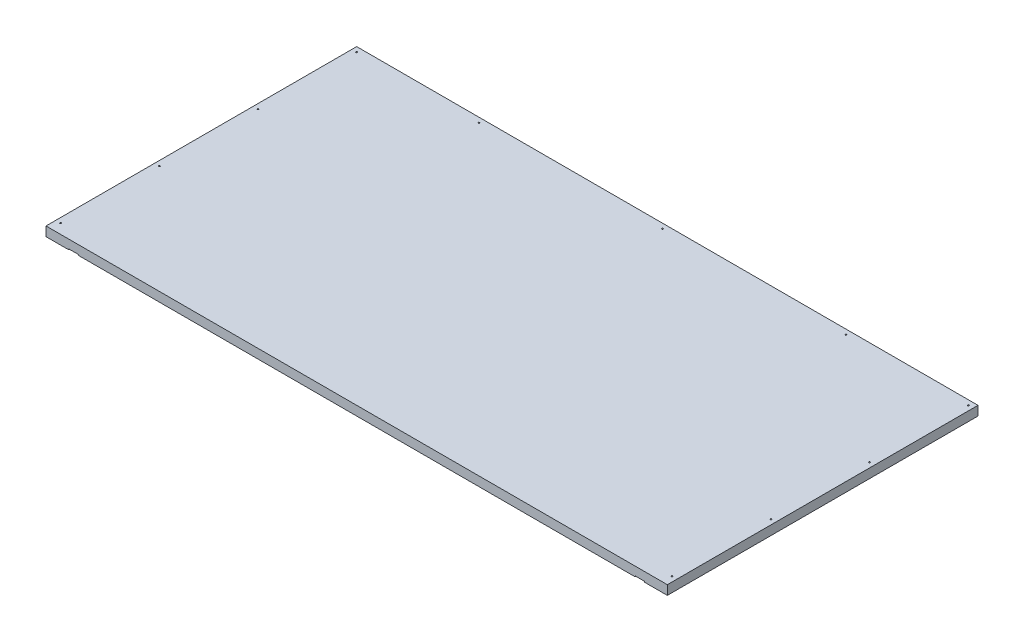
ISO-10303-21;
HEADER;
FILE_DESCRIPTION(('STEP AP214'),'2;1');
FILE_NAME('part.step','',(''),(''),'','','');
FILE_SCHEMA(('AUTOMOTIVE_DESIGN { 1 0 10303 214 1 1 1 1 }'));
ENDSEC;
DATA;
#1=APPLICATION_CONTEXT('core data for automotive mechanical design processes');
#2=APPLICATION_PROTOCOL_DEFINITION('international standard','automotive_design',2000,#1);
#3=PRODUCT_CONTEXT('',#1,'mechanical');
#4=PRODUCT('Part','Part','',(#3));
#5=PRODUCT_RELATED_PRODUCT_CATEGORY('part','',(#4));
#6=PRODUCT_DEFINITION_FORMATION('','',#4);
#7=PRODUCT_DEFINITION_CONTEXT('part definition',#1,'design');
#8=PRODUCT_DEFINITION('design','',#6,#7);
#9=PRODUCT_DEFINITION_SHAPE('','',#8);
#10=(LENGTH_UNIT() NAMED_UNIT(*) SI_UNIT(.MILLI.,.METRE.));
#11=(NAMED_UNIT(*) PLANE_ANGLE_UNIT() SI_UNIT($,.RADIAN.));
#12=(NAMED_UNIT(*) SI_UNIT($,.STERADIAN.) SOLID_ANGLE_UNIT());
#13=UNCERTAINTY_MEASURE_WITH_UNIT(LENGTH_MEASURE(1.E-05),#10,'distance_accuracy_value','');
#14=(GEOMETRIC_REPRESENTATION_CONTEXT(3) GLOBAL_UNCERTAINTY_ASSIGNED_CONTEXT((#13)) GLOBAL_UNIT_ASSIGNED_CONTEXT((#10,
#11,#12)) REPRESENTATION_CONTEXT('',''));
#15=CARTESIAN_POINT('',(0.,0.,0.));
#16=DIRECTION('',(0.,0.,1.));
#17=DIRECTION('',(1.,0.,0.));
#18=AXIS2_PLACEMENT_3D('',#15,#16,#17);
#19=CARTESIAN_POINT('',(-609.6,18.25625,-304.8));
#20=DIRECTION('',(0.,0.,1.));
#21=DIRECTION('',(1.,0.,0.));
#22=AXIS2_PLACEMENT_3D('',#19,#20,#21);
#23=PLANE('',#22);
#24=DIRECTION('',(0.,-1.,0.));
#25=VECTOR('',#24,1.);
#26=CARTESIAN_POINT('',(565.15,1.5875,-304.8));
#27=LINE('',#26,#25);
#28=CARTESIAN_POINT('',(565.15,1.5875,-304.8));
#29=VERTEX_POINT('',#28);
#30=CARTESIAN_POINT('',(565.15,0.,-304.8));
#31=VERTEX_POINT('',#30);
#32=EDGE_CURVE('E388',#29,#31,#27,.T.);
#33=ORIENTED_EDGE('',*,*,#32,.F.);
#34=DIRECTION('',(-1.,0.,0.));
#35=VECTOR('',#34,1.);
#36=CARTESIAN_POINT('',(565.15,1.5875,-304.8));
#37=LINE('',#36,#35);
#38=CARTESIAN_POINT('',(546.1,1.5875,-304.8));
#39=VERTEX_POINT('',#38);
#40=EDGE_CURVE('E461',#29,#39,#37,.T.);
#41=ORIENTED_EDGE('',*,*,#40,.T.);
#42=DIRECTION('',(0.,-1.,0.));
#43=VECTOR('',#42,1.);
#44=CARTESIAN_POINT('',(546.1,1.5875,-304.8));
#45=LINE('',#44,#43);
#46=CARTESIAN_POINT('',(546.1,0.,-304.8));
#47=VERTEX_POINT('',#46);
#48=EDGE_CURVE('E384',#39,#47,#45,.T.);
#49=ORIENTED_EDGE('',*,*,#48,.T.);
#50=DIRECTION('',(-1.,0.,0.));
#51=VECTOR('',#50,1.);
#52=CARTESIAN_POINT('',(-609.6,0.,-304.8));
#53=LINE('',#52,#51);
#54=CARTESIAN_POINT('',(120.65,0.,-304.8));
#55=VERTEX_POINT('',#54);
#56=EDGE_CURVE('E266',#47,#55,#53,.T.);
#57=ORIENTED_EDGE('',*,*,#56,.T.);
#58=DIRECTION('',(0.,-1.,0.));
#59=VECTOR('',#58,1.);
#60=CARTESIAN_POINT('',(120.65,1.5875,-304.8));
#61=LINE('',#60,#59);
#62=CARTESIAN_POINT('',(120.65,1.5875,-304.8));
#63=VERTEX_POINT('',#62);
#64=EDGE_CURVE('E375',#63,#55,#61,.T.);
#65=ORIENTED_EDGE('',*,*,#64,.F.);
#66=DIRECTION('',(-1.,0.,0.));
#67=VECTOR('',#66,1.);
#68=CARTESIAN_POINT('',(101.6,1.5875,-304.8));
#69=LINE('',#68,#67);
#70=CARTESIAN_POINT('',(101.6,1.5875,-304.8));
#71=VERTEX_POINT('',#70);
#72=EDGE_CURVE('E448',#63,#71,#69,.T.);
#73=ORIENTED_EDGE('',*,*,#72,.T.);
#74=DIRECTION('',(0.,-1.,0.));
#75=VECTOR('',#74,1.);
#76=CARTESIAN_POINT('',(101.6,1.5875,-304.8));
#77=LINE('',#76,#75);
#78=CARTESIAN_POINT('',(101.6,0.,-304.8));
#79=VERTEX_POINT('',#78);
#80=EDGE_CURVE('E371',#71,#79,#77,.T.);
#81=ORIENTED_EDGE('',*,*,#80,.T.);
#82=CARTESIAN_POINT('',(-101.6,0.,-304.8));
#83=VERTEX_POINT('',#82);
#84=EDGE_CURVE('E416',#79,#83,#53,.T.);
#85=ORIENTED_EDGE('',*,*,#84,.T.);
#86=DIRECTION('',(0.,-1.,0.));
#87=VECTOR('',#86,1.);
#88=CARTESIAN_POINT('',(-101.6,1.5875,-304.8));
#89=LINE('',#88,#87);
#90=CARTESIAN_POINT('',(-101.6,1.5875,-304.8));
#91=VERTEX_POINT('',#90);
#92=EDGE_CURVE('E362',#91,#83,#89,.T.);
#93=ORIENTED_EDGE('',*,*,#92,.F.);
#94=DIRECTION('',(-1.,0.,0.));
#95=VECTOR('',#94,1.);
#96=CARTESIAN_POINT('',(-120.65,1.5875,-304.8));
#97=LINE('',#96,#95);
#98=CARTESIAN_POINT('',(-120.65,1.5875,-304.8));
#99=VERTEX_POINT('',#98);
#100=EDGE_CURVE('E435',#91,#99,#97,.T.);
#101=ORIENTED_EDGE('',*,*,#100,.T.);
#102=DIRECTION('',(0.,-1.,0.));
#103=VECTOR('',#102,1.);
#104=CARTESIAN_POINT('',(-120.65,1.5875,-304.8));
#105=LINE('',#104,#103);
#106=CARTESIAN_POINT('',(-120.65,0.,-304.8));
#107=VERTEX_POINT('',#106);
#108=EDGE_CURVE('E358',#99,#107,#105,.T.);
#109=ORIENTED_EDGE('',*,*,#108,.T.);
#110=CARTESIAN_POINT('',(-546.1,0.,-304.8));
#111=VERTEX_POINT('',#110);
#112=EDGE_CURVE('E419',#107,#111,#53,.T.);
#113=ORIENTED_EDGE('',*,*,#112,.T.);
#114=DIRECTION('',(0.,-1.,0.));
#115=VECTOR('',#114,1.);
#116=CARTESIAN_POINT('',(-546.1,1.5875,-304.8));
#117=LINE('',#116,#115);
#118=CARTESIAN_POINT('',(-546.1,1.5875,-304.8));
#119=VERTEX_POINT('',#118);
#120=EDGE_CURVE('E54',#119,#111,#117,.T.);
#121=ORIENTED_EDGE('',*,*,#120,.F.);
#122=DIRECTION('',(-1.,0.,0.));
#123=VECTOR('',#122,1.);
#124=CARTESIAN_POINT('',(-565.15,1.5875,-304.8));
#125=LINE('',#124,#123);
#126=CARTESIAN_POINT('',(-565.15,1.5875,-304.8));
#127=VERTEX_POINT('',#126);
#128=EDGE_CURVE('E300',#119,#127,#125,.T.);
#129=ORIENTED_EDGE('',*,*,#128,.T.);
#130=DIRECTION('',(0.,-1.,0.));
#131=VECTOR('',#130,1.);
#132=CARTESIAN_POINT('',(-565.15,1.5875,-304.8));
#133=LINE('',#132,#131);
#134=CARTESIAN_POINT('',(-565.15,0.,-304.8));
#135=VERTEX_POINT('',#134);
#136=EDGE_CURVE('E228',#127,#135,#133,.T.);
#137=ORIENTED_EDGE('',*,*,#136,.T.);
#138=CARTESIAN_POINT('',(-609.6,0.,-304.8));
#139=VERTEX_POINT('',#138);
#140=EDGE_CURVE('E244',#135,#139,#53,.T.);
#141=ORIENTED_EDGE('',*,*,#140,.T.);
#142=DIRECTION('',(0.,-1.,0.));
#143=VECTOR('',#142,1.);
#144=CARTESIAN_POINT('',(-609.6,18.25625,-304.8));
#145=LINE('',#144,#143);
#146=CARTESIAN_POINT('',(-609.6,18.25625,-304.8));
#147=VERTEX_POINT('',#146);
#148=EDGE_CURVE('E47',#147,#139,#145,.T.);
#149=ORIENTED_EDGE('',*,*,#148,.F.);
#150=DIRECTION('',(-1.,0.,0.));
#151=VECTOR('',#150,1.);
#152=CARTESIAN_POINT('',(-609.6,18.25625,-304.8));
#153=LINE('',#152,#151);
#154=CARTESIAN_POINT('',(609.6,18.25625,-304.8));
#155=VERTEX_POINT('',#154);
#156=EDGE_CURVE('E91',#155,#147,#153,.T.);
#157=ORIENTED_EDGE('',*,*,#156,.F.);
#158=DIRECTION('',(0.,-1.,0.));
#159=VECTOR('',#158,1.);
#160=CARTESIAN_POINT('',(609.6,18.25625,-304.8));
#161=LINE('',#160,#159);
#162=CARTESIAN_POINT('',(609.6,0.,-304.8));
#163=VERTEX_POINT('',#162);
#164=EDGE_CURVE('E11',#155,#163,#161,.T.);
#165=ORIENTED_EDGE('',*,*,#164,.T.);
#166=EDGE_CURVE('E261',#163,#31,#53,.T.);
#167=ORIENTED_EDGE('',*,*,#166,.T.);
#168=EDGE_LOOP('',(#33,#41,#49,#57,#65,#73,#81,#85,#93,#101,#109,#113,#121,#129,#137,#141,#149,
#157,#165,#167));
#169=FACE_BOUND('',#168,.T.);
#170=ADVANCED_FACE('F38',(#169),#23,.F.);
#171=CARTESIAN_POINT('',(-609.6,18.25625,304.8));
#172=DIRECTION('',(0.,0.,-1.));
#173=DIRECTION('',(-1.,0.,0.));
#174=AXIS2_PLACEMENT_3D('',#171,#172,#173);
#175=PLANE('',#174);
#176=DIRECTION('',(0.,-1.,0.));
#177=VECTOR('',#176,1.);
#178=CARTESIAN_POINT('',(-565.15,1.5875,304.8));
#179=LINE('',#178,#177);
#180=CARTESIAN_POINT('',(-565.15,1.5875,304.8));
#181=VERTEX_POINT('',#180);
#182=CARTESIAN_POINT('',(-565.15,0.,304.8));
#183=VERTEX_POINT('',#182);
#184=EDGE_CURVE('E225',#181,#183,#179,.T.);
#185=ORIENTED_EDGE('',*,*,#184,.F.);
#186=DIRECTION('',(1.,0.,0.));
#187=VECTOR('',#186,1.);
#188=CARTESIAN_POINT('',(-565.15,1.5875,304.8));
#189=LINE('',#188,#187);
#190=CARTESIAN_POINT('',(-546.1,1.5875,304.8));
#191=VERTEX_POINT('',#190);
#192=EDGE_CURVE('E211',#181,#191,#189,.T.);
#193=ORIENTED_EDGE('',*,*,#192,.T.);
#194=DIRECTION('',(0.,-1.,0.));
#195=VECTOR('',#194,1.);
#196=CARTESIAN_POINT('',(-546.1,1.5875,304.8));
#197=LINE('',#196,#195);
#198=CARTESIAN_POINT('',(-546.1,0.,304.8));
#199=VERTEX_POINT('',#198);
#200=EDGE_CURVE('E239',#191,#199,#197,.T.);
#201=ORIENTED_EDGE('',*,*,#200,.T.);
#202=DIRECTION('',(1.,0.,0.));
#203=VECTOR('',#202,1.);
#204=CARTESIAN_POINT('',(-609.6,0.,304.8));
#205=LINE('',#204,#203);
#206=CARTESIAN_POINT('',(546.1,0.,304.8));
#207=VERTEX_POINT('',#206);
#208=EDGE_CURVE('E271',#199,#207,#205,.T.);
#209=ORIENTED_EDGE('',*,*,#208,.T.);
#210=DIRECTION('',(0.,-1.,0.));
#211=VECTOR('',#210,1.);
#212=CARTESIAN_POINT('',(546.1,1.5875,304.8));
#213=LINE('',#212,#211);
#214=CARTESIAN_POINT('',(546.1,1.5875,304.8));
#215=VERTEX_POINT('',#214);
#216=EDGE_CURVE('E394',#215,#207,#213,.T.);
#217=ORIENTED_EDGE('',*,*,#216,.F.);
#218=DIRECTION('',(1.,0.,0.));
#219=VECTOR('',#218,1.);
#220=CARTESIAN_POINT('',(565.15,1.5875,304.8));
#221=LINE('',#220,#219);
#222=CARTESIAN_POINT('',(565.15,1.5875,304.8));
#223=VERTEX_POINT('',#222);
#224=EDGE_CURVE('E468',#215,#223,#221,.T.);
#225=ORIENTED_EDGE('',*,*,#224,.T.);
#226=DIRECTION('',(0.,-1.,0.));
#227=VECTOR('',#226,1.);
#228=CARTESIAN_POINT('',(565.15,1.5875,304.8));
#229=LINE('',#228,#227);
#230=CARTESIAN_POINT('',(565.15,0.,304.8));
#231=VERTEX_POINT('',#230);
#232=EDGE_CURVE('E391',#223,#231,#229,.T.);
#233=ORIENTED_EDGE('',*,*,#232,.T.);
#234=CARTESIAN_POINT('',(609.6,0.,304.8));
#235=VERTEX_POINT('',#234);
#236=EDGE_CURVE('E84',#231,#235,#205,.T.);
#237=ORIENTED_EDGE('',*,*,#236,.T.);
#238=DIRECTION('',(0.,-1.,0.));
#239=VECTOR('',#238,1.);
#240=CARTESIAN_POINT('',(609.6,18.25625,304.8));
#241=LINE('',#240,#239);
#242=CARTESIAN_POINT('',(609.6,18.25625,304.8));
#243=VERTEX_POINT('',#242);
#244=EDGE_CURVE('E259',#243,#235,#241,.T.);
#245=ORIENTED_EDGE('',*,*,#244,.F.);
#246=DIRECTION('',(1.,0.,0.));
#247=VECTOR('',#246,1.);
#248=CARTESIAN_POINT('',(-609.6,18.25625,304.8));
#249=LINE('',#248,#247);
#250=CARTESIAN_POINT('',(-609.6,18.25625,304.8));
#251=VERTEX_POINT('',#250);
#252=EDGE_CURVE('E63',#251,#243,#249,.T.);
#253=ORIENTED_EDGE('',*,*,#252,.F.);
#254=DIRECTION('',(0.,-1.,0.));
#255=VECTOR('',#254,1.);
#256=CARTESIAN_POINT('',(-609.6,18.25625,304.8));
#257=LINE('',#256,#255);
#258=CARTESIAN_POINT('',(-609.6,0.,304.8));
#259=VERTEX_POINT('',#258);
#260=EDGE_CURVE('E274',#251,#259,#257,.T.);
#261=ORIENTED_EDGE('',*,*,#260,.T.);
#262=EDGE_CURVE('E236',#259,#183,#205,.T.);
#263=ORIENTED_EDGE('',*,*,#262,.T.);
#264=EDGE_LOOP('',(#185,#193,#201,#209,#217,#225,#233,#237,#245,#253,#261,#263));
#265=FACE_BOUND('',#264,.T.);
#266=ADVANCED_FACE('F233',(#265),#175,.F.);
#267=CARTESIAN_POINT('',(0.,0.,0.));
#268=DIRECTION('',(0.,-1.,0.));
#269=DIRECTION('',(0.,0.,-1.));
#270=AXIS2_PLACEMENT_3D('',#267,#268,#269);
#271=PLANE('',#270);
#272=CARTESIAN_POINT('',(-600.075000000001,0.,92.0750000000001));
#273=DIRECTION('',(0.,1.,0.));
#274=DIRECTION('',(0.,0.,1.));
#275=AXIS2_PLACEMENT_3D('',#272,#273,#274);
#276=CIRCLE('',#275,1.39699999999999);
#277=CARTESIAN_POINT('',(-600.075000000001,0.,93.4720000000001));
#278=VERTEX_POINT('',#277);
#279=EDGE_CURVE('E536',#278,#278,#276,.T.);
#280=ORIENTED_EDGE('',*,*,#279,.T.);
#281=EDGE_LOOP('',(#280));
#282=FACE_BOUND('',#281,.T.);
#283=CARTESIAN_POINT('',(-600.075000000001,0.,-101.6));
#284=DIRECTION('',(0.,1.,0.));
#285=DIRECTION('',(0.,0.,1.));
#286=AXIS2_PLACEMENT_3D('',#283,#284,#285);
#287=CIRCLE('',#286,1.39699999999999);
#288=CARTESIAN_POINT('',(-600.075000000001,0.,-100.203));
#289=VERTEX_POINT('',#288);
#290=EDGE_CURVE('E537',#289,#289,#287,.T.);
#291=ORIENTED_EDGE('',*,*,#290,.T.);
#292=EDGE_LOOP('',(#291));
#293=FACE_BOUND('',#292,.T.);
#294=CARTESIAN_POINT('',(-600.075000000002,0.,-295.275));
#295=DIRECTION('',(0.,1.,0.));
#296=DIRECTION('',(0.,0.,1.));
#297=AXIS2_PLACEMENT_3D('',#294,#295,#296);
#298=CIRCLE('',#297,1.39699999999998);
#299=CARTESIAN_POINT('',(-600.075000000002,0.,-293.878));
#300=VERTEX_POINT('',#299);
#301=EDGE_CURVE('E552',#300,#300,#298,.T.);
#302=ORIENTED_EDGE('',*,*,#301,.T.);
#303=EDGE_LOOP('',(#302));
#304=FACE_BOUND('',#303,.T.);
#305=CARTESIAN_POINT('',(-600.075,0.,285.75));
#306=DIRECTION('',(0.,1.,0.));
#307=DIRECTION('',(0.,0.,1.));
#308=AXIS2_PLACEMENT_3D('',#305,#306,#307);
#309=CIRCLE('',#308,1.39699999999998);
#310=CARTESIAN_POINT('',(-600.075,0.,287.147));
#311=VERTEX_POINT('',#310);
#312=EDGE_CURVE('E289',#311,#311,#309,.T.);
#313=ORIENTED_EDGE('',*,*,#312,.T.);
#314=EDGE_LOOP('',(#313));
#315=FACE_BOUND('',#314,.T.);
#316=ORIENTED_EDGE('',*,*,#140,.F.);
#317=DIRECTION('',(0.,0.,1.));
#318=VECTOR('',#317,1.);
#319=CARTESIAN_POINT('',(-565.15,0.,-304.8));
#320=LINE('',#319,#318);
#321=EDGE_CURVE('E286',#135,#183,#320,.T.);
#322=ORIENTED_EDGE('',*,*,#321,.T.);
#323=ORIENTED_EDGE('',*,*,#262,.F.);
#324=DIRECTION('',(0.,0.,1.));
#325=VECTOR('',#324,1.);
#326=CARTESIAN_POINT('',(-609.6,0.,304.8));
#327=LINE('',#326,#325);
#328=EDGE_CURVE('E265',#139,#259,#327,.T.);
#329=ORIENTED_EDGE('',*,*,#328,.F.);
#330=EDGE_LOOP('',(#316,#322,#323,#329));
#331=FACE_BOUND('',#330,.T.);
#332=ADVANCED_FACE('F285',(#282,#293,#304,#315,#331),#271,.T.);
#333=ORIENTED_EDGE('',*,*,#208,.F.);
#334=DIRECTION('',(0.,0.,-1.));
#335=VECTOR('',#334,1.);
#336=CARTESIAN_POINT('',(-546.1,0.,9.52500000000006));
#337=LINE('',#336,#335);
#338=CARTESIAN_POINT('',(-546.1,0.,9.52500000000006));
#339=VERTEX_POINT('',#338);
#340=EDGE_CURVE('E288',#199,#339,#337,.T.);
#341=ORIENTED_EDGE('',*,*,#340,.T.);
#342=DIRECTION('',(1.,0.,0.));
#343=VECTOR('',#342,1.);
#344=CARTESIAN_POINT('',(120.65,0.,9.52500000000003));
#345=LINE('',#344,#343);
#346=CARTESIAN_POINT('',(546.1,0.,9.52500000000006));
#347=VERTEX_POINT('',#346);
#348=EDGE_CURVE('E294',#339,#347,#345,.T.);
#349=ORIENTED_EDGE('',*,*,#348,.T.);
#350=DIRECTION('',(0.,0.,1.));
#351=VECTOR('',#350,1.);
#352=CARTESIAN_POINT('',(546.1,0.,9.52500000000006));
#353=LINE('',#352,#351);
#354=EDGE_CURVE('E306',#347,#207,#353,.T.);
#355=ORIENTED_EDGE('',*,*,#354,.T.);
#356=EDGE_LOOP('',(#333,#341,#349,#355));
#357=FACE_BOUND('',#356,.T.);
#358=ADVANCED_FACE('F407',(#357),#271,.T.);
#359=CARTESIAN_POINT('',(600.074999999999,0.,-295.275));
#360=DIRECTION('',(0.,1.,0.));
#361=DIRECTION('',(0.,0.,1.));
#362=AXIS2_PLACEMENT_3D('',#359,#360,#361);
#363=CIRCLE('',#362,1.39699999999998);
#364=CARTESIAN_POINT('',(600.074999999999,0.,-293.878));
#365=VERTEX_POINT('',#364);
#366=EDGE_CURVE('E521',#365,#365,#363,.T.);
#367=ORIENTED_EDGE('',*,*,#366,.T.);
#368=EDGE_LOOP('',(#367));
#369=FACE_BOUND('',#368,.T.);
#370=CARTESIAN_POINT('',(600.075,0.,-101.6));
#371=DIRECTION('',(0.,1.,0.));
#372=DIRECTION('',(0.,0.,1.));
#373=AXIS2_PLACEMENT_3D('',#370,#371,#372);
#374=CIRCLE('',#373,1.39699999999999);
#375=CARTESIAN_POINT('',(600.075,0.,-100.203));
#376=VERTEX_POINT('',#375);
#377=EDGE_CURVE('E497',#376,#376,#374,.T.);
#378=ORIENTED_EDGE('',*,*,#377,.T.);
#379=EDGE_LOOP('',(#378));
#380=FACE_BOUND('',#379,.T.);
#381=CARTESIAN_POINT('',(600.075000000001,0.,92.0750000000001));
#382=DIRECTION('',(0.,1.,0.));
#383=DIRECTION('',(0.,0.,1.));
#384=AXIS2_PLACEMENT_3D('',#381,#382,#383);
#385=CIRCLE('',#384,1.39699999999999);
#386=CARTESIAN_POINT('',(600.075000000001,0.,93.4720000000001));
#387=VERTEX_POINT('',#386);
#388=EDGE_CURVE('E505',#387,#387,#385,.T.);
#389=ORIENTED_EDGE('',*,*,#388,.T.);
#390=EDGE_LOOP('',(#389));
#391=FACE_BOUND('',#390,.T.);
#392=CARTESIAN_POINT('',(600.075000000001,0.,285.75));
#393=DIRECTION('',(0.,1.,0.));
#394=DIRECTION('',(0.,0.,1.));
#395=AXIS2_PLACEMENT_3D('',#392,#393,#394);
#396=CIRCLE('',#395,1.39699999999998);
#397=CARTESIAN_POINT('',(600.075000000001,0.,287.147));
#398=VERTEX_POINT('',#397);
#399=EDGE_CURVE('E482',#398,#398,#396,.T.);
#400=ORIENTED_EDGE('',*,*,#399,.T.);
#401=EDGE_LOOP('',(#400));
#402=FACE_BOUND('',#401,.T.);
#403=ORIENTED_EDGE('',*,*,#236,.F.);
#404=DIRECTION('',(0.,0.,-1.));
#405=VECTOR('',#404,1.);
#406=CARTESIAN_POINT('',(565.15,0.,-304.8));
#407=LINE('',#406,#405);
#408=EDGE_CURVE('E310',#231,#31,#407,.T.);
#409=ORIENTED_EDGE('',*,*,#408,.T.);
#410=ORIENTED_EDGE('',*,*,#166,.F.);
#411=DIRECTION('',(0.,0.,-1.));
#412=VECTOR('',#411,1.);
#413=CARTESIAN_POINT('',(609.6,0.,304.8));
#414=LINE('',#413,#412);
#415=EDGE_CURVE('E238',#235,#163,#414,.T.);
#416=ORIENTED_EDGE('',*,*,#415,.F.);
#417=EDGE_LOOP('',(#403,#409,#410,#416));
#418=FACE_BOUND('',#417,.T.);
#419=ADVANCED_FACE('F587',(#369,#380,#391,#402,#418),#271,.T.);
#420=CARTESIAN_POINT('',(360.044999999999,0.,-295.275));
#421=DIRECTION('',(0.,1.,0.));
#422=DIRECTION('',(0.,0.,1.));
#423=AXIS2_PLACEMENT_3D('',#420,#421,#422);
#424=CIRCLE('',#423,1.39699999999998);
#425=CARTESIAN_POINT('',(360.044999999999,0.,-293.878));
#426=VERTEX_POINT('',#425);
#427=EDGE_CURVE('E520',#426,#426,#424,.T.);
#428=ORIENTED_EDGE('',*,*,#427,.T.);
#429=EDGE_LOOP('',(#428));
#430=FACE_BOUND('',#429,.T.);
#431=ORIENTED_EDGE('',*,*,#56,.F.);
#432=DIRECTION('',(0.,0.,1.));
#433=VECTOR('',#432,1.);
#434=CARTESIAN_POINT('',(546.1,0.,-304.8));
#435=LINE('',#434,#433);
#436=CARTESIAN_POINT('',(546.1,0.,-9.52500000000033));
#437=VERTEX_POINT('',#436);
#438=EDGE_CURVE('E314',#47,#437,#435,.T.);
#439=ORIENTED_EDGE('',*,*,#438,.T.);
#440=DIRECTION('',(-1.,0.,0.));
#441=VECTOR('',#440,1.);
#442=CARTESIAN_POINT('',(120.65,0.,-9.5250000000002));
#443=LINE('',#442,#441);
#444=CARTESIAN_POINT('',(120.65,0.,-9.5250000000002));
#445=VERTEX_POINT('',#444);
#446=EDGE_CURVE('E318',#437,#445,#443,.T.);
#447=ORIENTED_EDGE('',*,*,#446,.T.);
#448=DIRECTION('',(0.,0.,-1.));
#449=VECTOR('',#448,1.);
#450=CARTESIAN_POINT('',(120.65,0.,-9.5250000000002));
#451=LINE('',#450,#449);
#452=EDGE_CURVE('E322',#445,#55,#451,.T.);
#453=ORIENTED_EDGE('',*,*,#452,.T.);
#454=EDGE_LOOP('',(#431,#439,#447,#453));
#455=FACE_BOUND('',#454,.T.);
#456=ADVANCED_FACE('F600',(#430,#455),#271,.T.);
#457=CARTESIAN_POINT('',(-1.11022302462516E-13,0.,-295.275));
#458=DIRECTION('',(0.,1.,0.));
#459=DIRECTION('',(0.,0.,1.));
#460=AXIS2_PLACEMENT_3D('',#457,#458,#459);
#461=CIRCLE('',#460,1.39699999999996);
#462=CARTESIAN_POINT('',(-1.11022302462516E-13,0.,-293.878));
#463=VERTEX_POINT('',#462);
#464=EDGE_CURVE('E489',#463,#463,#461,.T.);
#465=ORIENTED_EDGE('',*,*,#464,.T.);
#466=EDGE_LOOP('',(#465));
#467=FACE_BOUND('',#466,.T.);
#468=ORIENTED_EDGE('',*,*,#84,.F.);
#469=DIRECTION('',(0.,0.,1.));
#470=VECTOR('',#469,1.);
#471=CARTESIAN_POINT('',(101.6,0.,-9.52500000000006));
#472=LINE('',#471,#470);
#473=CARTESIAN_POINT('',(101.6,0.,-9.52500000000006));
#474=VERTEX_POINT('',#473);
#475=EDGE_CURVE('E326',#79,#474,#472,.T.);
#476=ORIENTED_EDGE('',*,*,#475,.T.);
#477=DIRECTION('',(-1.,0.,0.));
#478=VECTOR('',#477,1.);
#479=CARTESIAN_POINT('',(-101.6,0.,-9.52500000000012));
#480=LINE('',#479,#478);
#481=CARTESIAN_POINT('',(-101.6,0.,-9.52500000000012));
#482=VERTEX_POINT('',#481);
#483=EDGE_CURVE('E330',#474,#482,#480,.T.);
#484=ORIENTED_EDGE('',*,*,#483,.T.);
#485=DIRECTION('',(0.,0.,-1.));
#486=VECTOR('',#485,1.);
#487=CARTESIAN_POINT('',(-101.6,0.,-304.8));
#488=LINE('',#487,#486);
#489=EDGE_CURVE('E334',#482,#83,#488,.T.);
#490=ORIENTED_EDGE('',*,*,#489,.T.);
#491=EDGE_LOOP('',(#468,#476,#484,#490));
#492=FACE_BOUND('',#491,.T.);
#493=ADVANCED_FACE('F621',(#467,#492),#271,.T.);
#494=CARTESIAN_POINT('',(-360.045000000002,0.,-295.275));
#495=DIRECTION('',(0.,1.,0.));
#496=DIRECTION('',(0.,0.,1.));
#497=AXIS2_PLACEMENT_3D('',#494,#495,#496);
#498=CIRCLE('',#497,1.39699999999998);
#499=CARTESIAN_POINT('',(-360.045000000002,0.,-293.878));
#500=VERTEX_POINT('',#499);
#501=EDGE_CURVE('E488',#500,#500,#498,.T.);
#502=ORIENTED_EDGE('',*,*,#501,.T.);
#503=EDGE_LOOP('',(#502));
#504=FACE_BOUND('',#503,.T.);
#505=ORIENTED_EDGE('',*,*,#112,.F.);
#506=DIRECTION('',(0.,0.,1.));
#507=VECTOR('',#506,1.);
#508=CARTESIAN_POINT('',(-120.65,0.,-304.8));
#509=LINE('',#508,#507);
#510=CARTESIAN_POINT('',(-120.65,0.,-9.52500000000012));
#511=VERTEX_POINT('',#510);
#512=EDGE_CURVE('E338',#107,#511,#509,.T.);
#513=ORIENTED_EDGE('',*,*,#512,.T.);
#514=DIRECTION('',(-1.,0.,0.));
#515=VECTOR('',#514,1.);
#516=CARTESIAN_POINT('',(-546.1,0.,-9.52500000000006));
#517=LINE('',#516,#515);
#518=CARTESIAN_POINT('',(-546.1,0.,-9.52500000000006));
#519=VERTEX_POINT('',#518);
#520=EDGE_CURVE('E342',#511,#519,#517,.T.);
#521=ORIENTED_EDGE('',*,*,#520,.T.);
#522=DIRECTION('',(0.,0.,-1.));
#523=VECTOR('',#522,1.);
#524=CARTESIAN_POINT('',(-546.1,0.,-304.8));
#525=LINE('',#524,#523);
#526=EDGE_CURVE('E230',#519,#111,#525,.T.);
#527=ORIENTED_EDGE('',*,*,#526,.T.);
#528=EDGE_LOOP('',(#505,#513,#521,#527));
#529=FACE_BOUND('',#528,.T.);
#530=ADVANCED_FACE('F636',(#504,#529),#271,.T.);
#531=CARTESIAN_POINT('',(609.6,18.25625,304.8));
#532=DIRECTION('',(-1.,0.,0.));
#533=DIRECTION('',(0.,0.,1.));
#534=AXIS2_PLACEMENT_3D('',#531,#532,#533);
#535=PLANE('',#534);
#536=ORIENTED_EDGE('',*,*,#415,.T.);
#537=ORIENTED_EDGE('',*,*,#164,.F.);
#538=DIRECTION('',(0.,0.,-1.));
#539=VECTOR('',#538,1.);
#540=CARTESIAN_POINT('',(609.6,18.25625,304.8));
#541=LINE('',#540,#539);
#542=EDGE_CURVE('E250',#243,#155,#541,.T.);
#543=ORIENTED_EDGE('',*,*,#542,.F.);
#544=ORIENTED_EDGE('',*,*,#244,.T.);
#545=EDGE_LOOP('',(#536,#537,#543,#544));
#546=FACE_BOUND('',#545,.T.);
#547=ADVANCED_FACE('F40',(#546),#535,.F.);
#548=CARTESIAN_POINT('',(-609.6,18.25625,304.8));
#549=DIRECTION('',(1.,0.,0.));
#550=DIRECTION('',(0.,0.,-1.));
#551=AXIS2_PLACEMENT_3D('',#548,#549,#550);
#552=PLANE('',#551);
#553=ORIENTED_EDGE('',*,*,#328,.T.);
#554=ORIENTED_EDGE('',*,*,#260,.F.);
#555=DIRECTION('',(0.,0.,1.));
#556=VECTOR('',#555,1.);
#557=CARTESIAN_POINT('',(-609.6,18.25625,304.8));
#558=LINE('',#557,#556);
#559=EDGE_CURVE('E255',#147,#251,#558,.T.);
#560=ORIENTED_EDGE('',*,*,#559,.F.);
#561=ORIENTED_EDGE('',*,*,#148,.T.);
#562=EDGE_LOOP('',(#553,#554,#560,#561));
#563=FACE_BOUND('',#562,.T.);
#564=ADVANCED_FACE('F281',(#563),#552,.F.);
#565=CARTESIAN_POINT('',(0.,18.25625,0.));
#566=DIRECTION('',(0.,-1.,0.));
#567=DIRECTION('',(0.,0.,-1.));
#568=AXIS2_PLACEMENT_3D('',#565,#566,#567);
#569=PLANE('',#568);
#570=CARTESIAN_POINT('',(-1.11022302462516E-13,18.25625,-295.275));
#571=DIRECTION('',(0.,1.,0.));
#572=DIRECTION('',(0.,0.,1.));
#573=AXIS2_PLACEMENT_3D('',#570,#571,#572);
#574=CIRCLE('',#573,1.39699999999996);
#575=CARTESIAN_POINT('',(-1.11022302462516E-13,18.25625,-293.878));
#576=VERTEX_POINT('',#575);
#577=EDGE_CURVE('E525',#576,#576,#574,.T.);
#578=ORIENTED_EDGE('',*,*,#577,.F.);
#579=EDGE_LOOP('',(#578));
#580=FACE_BOUND('',#579,.T.);
#581=CARTESIAN_POINT('',(360.044999999999,18.25625,-295.275));
#582=DIRECTION('',(0.,1.,0.));
#583=DIRECTION('',(0.,0.,1.));
#584=AXIS2_PLACEMENT_3D('',#581,#582,#583);
#585=CIRCLE('',#584,1.39699999999998);
#586=CARTESIAN_POINT('',(360.044999999999,18.25625,-293.878));
#587=VERTEX_POINT('',#586);
#588=EDGE_CURVE('E516',#587,#587,#585,.T.);
#589=ORIENTED_EDGE('',*,*,#588,.F.);
#590=EDGE_LOOP('',(#589));
#591=FACE_BOUND('',#590,.T.);
#592=CARTESIAN_POINT('',(600.074999999999,18.25625,-295.275));
#593=DIRECTION('',(0.,1.,0.));
#594=DIRECTION('',(0.,0.,1.));
#595=AXIS2_PLACEMENT_3D('',#592,#593,#594);
#596=CIRCLE('',#595,1.39699999999998);
#597=CARTESIAN_POINT('',(600.074999999999,18.25625,-293.878));
#598=VERTEX_POINT('',#597);
#599=EDGE_CURVE('E541',#598,#598,#596,.T.);
#600=ORIENTED_EDGE('',*,*,#599,.F.);
#601=EDGE_LOOP('',(#600));
#602=FACE_BOUND('',#601,.T.);
#603=CARTESIAN_POINT('',(-600.075000000001,18.25625,92.0750000000001));
#604=DIRECTION('',(0.,1.,0.));
#605=DIRECTION('',(0.,0.,1.));
#606=AXIS2_PLACEMENT_3D('',#603,#604,#605);
#607=CIRCLE('',#606,1.39699999999999);
#608=CARTESIAN_POINT('',(-600.075000000001,18.25625,93.4720000000001));
#609=VERTEX_POINT('',#608);
#610=EDGE_CURVE('E532',#609,#609,#607,.T.);
#611=ORIENTED_EDGE('',*,*,#610,.F.);
#612=EDGE_LOOP('',(#611));
#613=FACE_BOUND('',#612,.T.);
#614=CARTESIAN_POINT('',(-360.045000000002,18.25625,-295.275));
#615=DIRECTION('',(0.,1.,0.));
#616=DIRECTION('',(0.,0.,1.));
#617=AXIS2_PLACEMENT_3D('',#614,#615,#616);
#618=CIRCLE('',#617,1.39699999999998);
#619=CARTESIAN_POINT('',(-360.045000000002,18.25625,-293.878));
#620=VERTEX_POINT('',#619);
#621=EDGE_CURVE('E484',#620,#620,#618,.T.);
#622=ORIENTED_EDGE('',*,*,#621,.F.);
#623=EDGE_LOOP('',(#622));
#624=FACE_BOUND('',#623,.T.);
#625=CARTESIAN_POINT('',(600.075,18.25625,-101.6));
#626=DIRECTION('',(0.,1.,0.));
#627=DIRECTION('',(0.,0.,1.));
#628=AXIS2_PLACEMENT_3D('',#625,#626,#627);
#629=CIRCLE('',#628,1.39699999999999);
#630=CARTESIAN_POINT('',(600.075,18.25625,-100.203));
#631=VERTEX_POINT('',#630);
#632=EDGE_CURVE('E493',#631,#631,#629,.T.);
#633=ORIENTED_EDGE('',*,*,#632,.F.);
#634=EDGE_LOOP('',(#633));
#635=FACE_BOUND('',#634,.T.);
#636=CARTESIAN_POINT('',(600.075000000001,18.25625,92.0750000000001));
#637=DIRECTION('',(0.,1.,0.));
#638=DIRECTION('',(0.,0.,1.));
#639=AXIS2_PLACEMENT_3D('',#636,#637,#638);
#640=CIRCLE('',#639,1.39699999999999);
#641=CARTESIAN_POINT('',(600.075000000001,18.25625,93.4720000000001));
#642=VERTEX_POINT('',#641);
#643=EDGE_CURVE('E501',#642,#642,#640,.T.);
#644=ORIENTED_EDGE('',*,*,#643,.F.);
#645=EDGE_LOOP('',(#644));
#646=FACE_BOUND('',#645,.T.);
#647=CARTESIAN_POINT('',(600.075000000001,18.25625,285.75));
#648=DIRECTION('',(0.,1.,0.));
#649=DIRECTION('',(0.,0.,1.));
#650=AXIS2_PLACEMENT_3D('',#647,#648,#649);
#651=CIRCLE('',#650,1.39699999999998);
#652=CARTESIAN_POINT('',(600.075000000001,18.25625,287.147));
#653=VERTEX_POINT('',#652);
#654=EDGE_CURVE('E509',#653,#653,#651,.T.);
#655=ORIENTED_EDGE('',*,*,#654,.F.);
#656=EDGE_LOOP('',(#655));
#657=FACE_BOUND('',#656,.T.);
#658=CARTESIAN_POINT('',(-600.075000000001,18.25625,-101.6));
#659=DIRECTION('',(0.,1.,0.));
#660=DIRECTION('',(0.,0.,1.));
#661=AXIS2_PLACEMENT_3D('',#658,#659,#660);
#662=CIRCLE('',#661,1.39699999999999);
#663=CARTESIAN_POINT('',(-600.075000000001,18.25625,-100.203));
#664=VERTEX_POINT('',#663);
#665=EDGE_CURVE('E556',#664,#664,#662,.T.);
#666=ORIENTED_EDGE('',*,*,#665,.F.);
#667=EDGE_LOOP('',(#666));
#668=FACE_BOUND('',#667,.T.);
#669=CARTESIAN_POINT('',(-600.075000000002,18.25625,-295.275));
#670=DIRECTION('',(0.,1.,0.));
#671=DIRECTION('',(0.,0.,1.));
#672=AXIS2_PLACEMENT_3D('',#669,#670,#671);
#673=CIRCLE('',#672,1.39699999999998);
#674=CARTESIAN_POINT('',(-600.075000000002,18.25625,-293.878));
#675=VERTEX_POINT('',#674);
#676=EDGE_CURVE('E548',#675,#675,#673,.T.);
#677=ORIENTED_EDGE('',*,*,#676,.F.);
#678=EDGE_LOOP('',(#677));
#679=FACE_BOUND('',#678,.T.);
#680=CARTESIAN_POINT('',(-600.075,18.25625,285.75));
#681=DIRECTION('',(0.,1.,0.));
#682=DIRECTION('',(0.,0.,1.));
#683=AXIS2_PLACEMENT_3D('',#680,#681,#682);
#684=CIRCLE('',#683,1.39699999999998);
#685=CARTESIAN_POINT('',(-600.075,18.25625,287.147));
#686=VERTEX_POINT('',#685);
#687=EDGE_CURVE('E297',#686,#686,#684,.T.);
#688=ORIENTED_EDGE('',*,*,#687,.F.);
#689=EDGE_LOOP('',(#688));
#690=FACE_BOUND('',#689,.T.);
#691=ORIENTED_EDGE('',*,*,#542,.T.);
#692=ORIENTED_EDGE('',*,*,#156,.T.);
#693=ORIENTED_EDGE('',*,*,#559,.T.);
#694=ORIENTED_EDGE('',*,*,#252,.T.);
#695=EDGE_LOOP('',(#691,#692,#693,#694));
#696=FACE_BOUND('',#695,.T.);
#697=ADVANCED_FACE('F574',(#580,#591,#602,#613,#624,#635,#646,#657,#668,#679,#690,#696),#569,.F.);
#698=CARTESIAN_POINT('',(-565.15,1.5875,-304.8));
#699=DIRECTION('',(1.,0.,0.));
#700=DIRECTION('',(0.,0.,-1.));
#701=AXIS2_PLACEMENT_3D('',#698,#699,#700);
#702=PLANE('',#701);
#703=ORIENTED_EDGE('',*,*,#321,.F.);
#704=ORIENTED_EDGE('',*,*,#136,.F.);
#705=DIRECTION('',(0.,0.,1.));
#706=VECTOR('',#705,1.);
#707=CARTESIAN_POINT('',(-565.15,1.5875,-304.8));
#708=LINE('',#707,#706);
#709=EDGE_CURVE('E215',#127,#181,#708,.T.);
#710=ORIENTED_EDGE('',*,*,#709,.T.);
#711=ORIENTED_EDGE('',*,*,#184,.T.);
#712=EDGE_LOOP('',(#703,#704,#710,#711));
#713=FACE_BOUND('',#712,.T.);
#714=ADVANCED_FACE('F224',(#713),#702,.T.);
#715=CARTESIAN_POINT('',(-546.1,1.5875,9.52500000000006));
#716=DIRECTION('',(-1.,0.,0.));
#717=DIRECTION('',(0.,0.,1.));
#718=AXIS2_PLACEMENT_3D('',#715,#716,#717);
#719=PLANE('',#718);
#720=ORIENTED_EDGE('',*,*,#340,.F.);
#721=ORIENTED_EDGE('',*,*,#200,.F.);
#722=DIRECTION('',(0.,0.,-1.));
#723=VECTOR('',#722,1.);
#724=CARTESIAN_POINT('',(-546.1,1.5875,9.52500000000006));
#725=LINE('',#724,#723);
#726=CARTESIAN_POINT('',(-546.1,1.5875,9.52500000000006));
#727=VERTEX_POINT('',#726);
#728=EDGE_CURVE('E218',#191,#727,#725,.T.);
#729=ORIENTED_EDGE('',*,*,#728,.T.);
#730=DIRECTION('',(0.,-1.,0.));
#731=VECTOR('',#730,1.);
#732=CARTESIAN_POINT('',(-546.1,1.5875,9.52500000000006));
#733=LINE('',#732,#731);
#734=EDGE_CURVE('E246',#727,#339,#733,.T.);
#735=ORIENTED_EDGE('',*,*,#734,.T.);
#736=EDGE_LOOP('',(#720,#721,#729,#735));
#737=FACE_BOUND('',#736,.T.);
#738=ADVANCED_FACE('F403',(#737),#719,.T.);
#739=CARTESIAN_POINT('',(120.65,1.5875,9.52500000000003));
#740=DIRECTION('',(0.,0.,-1.));
#741=DIRECTION('',(-1.,0.,0.));
#742=AXIS2_PLACEMENT_3D('',#739,#740,#741);
#743=PLANE('',#742);
#744=ORIENTED_EDGE('',*,*,#348,.F.);
#745=ORIENTED_EDGE('',*,*,#734,.F.);
#746=DIRECTION('',(1.,0.,0.));
#747=VECTOR('',#746,1.);
#748=CARTESIAN_POINT('',(-546.1,1.5875,9.52500000000006));
#749=LINE('',#748,#747);
#750=CARTESIAN_POINT('',(546.1,1.5875,9.52500000000006));
#751=VERTEX_POINT('',#750);
#752=EDGE_CURVE('E475',#727,#751,#749,.T.);
#753=ORIENTED_EDGE('',*,*,#752,.T.);
#754=DIRECTION('',(0.,-1.,0.));
#755=VECTOR('',#754,1.);
#756=CARTESIAN_POINT('',(546.1,1.5875,9.52500000000006));
#757=LINE('',#756,#755);
#758=EDGE_CURVE('E397',#751,#347,#757,.T.);
#759=ORIENTED_EDGE('',*,*,#758,.T.);
#760=EDGE_LOOP('',(#744,#745,#753,#759));
#761=FACE_BOUND('',#760,.T.);
#762=ADVANCED_FACE('F662',(#761),#743,.T.);
#763=CARTESIAN_POINT('',(546.1,1.5875,9.52500000000006));
#764=DIRECTION('',(1.,0.,0.));
#765=DIRECTION('',(0.,0.,-1.));
#766=AXIS2_PLACEMENT_3D('',#763,#764,#765);
#767=PLANE('',#766);
#768=ORIENTED_EDGE('',*,*,#354,.F.);
#769=ORIENTED_EDGE('',*,*,#758,.F.);
#770=DIRECTION('',(0.,0.,1.));
#771=VECTOR('',#770,1.);
#772=CARTESIAN_POINT('',(546.1,1.5875,9.52500000000006));
#773=LINE('',#772,#771);
#774=EDGE_CURVE('E472',#751,#215,#773,.T.);
#775=ORIENTED_EDGE('',*,*,#774,.T.);
#776=ORIENTED_EDGE('',*,*,#216,.T.);
#777=EDGE_LOOP('',(#768,#769,#775,#776));
#778=FACE_BOUND('',#777,.T.);
#779=ADVANCED_FACE('F665',(#778),#767,.T.);
#780=CARTESIAN_POINT('',(565.15,1.5875,-304.8));
#781=DIRECTION('',(-1.,0.,0.));
#782=DIRECTION('',(0.,0.,1.));
#783=AXIS2_PLACEMENT_3D('',#780,#781,#782);
#784=PLANE('',#783);
#785=ORIENTED_EDGE('',*,*,#408,.F.);
#786=ORIENTED_EDGE('',*,*,#232,.F.);
#787=DIRECTION('',(0.,0.,-1.));
#788=VECTOR('',#787,1.);
#789=CARTESIAN_POINT('',(565.15,1.5875,-304.8));
#790=LINE('',#789,#788);
#791=EDGE_CURVE('E465',#223,#29,#790,.T.);
#792=ORIENTED_EDGE('',*,*,#791,.T.);
#793=ORIENTED_EDGE('',*,*,#32,.T.);
#794=EDGE_LOOP('',(#785,#786,#792,#793));
#795=FACE_BOUND('',#794,.T.);
#796=ADVANCED_FACE('F589',(#795),#784,.T.);
#797=CARTESIAN_POINT('',(546.1,1.5875,-304.8));
#798=DIRECTION('',(1.,0.,0.));
#799=DIRECTION('',(0.,0.,-1.));
#800=AXIS2_PLACEMENT_3D('',#797,#798,#799);
#801=PLANE('',#800);
#802=ORIENTED_EDGE('',*,*,#438,.F.);
#803=ORIENTED_EDGE('',*,*,#48,.F.);
#804=DIRECTION('',(0.,0.,1.));
#805=VECTOR('',#804,1.);
#806=CARTESIAN_POINT('',(546.1,1.5875,-304.8));
#807=LINE('',#806,#805);
#808=CARTESIAN_POINT('',(546.1,1.5875,-9.52500000000033));
#809=VERTEX_POINT('',#808);
#810=EDGE_CURVE('E458',#39,#809,#807,.T.);
#811=ORIENTED_EDGE('',*,*,#810,.T.);
#812=DIRECTION('',(0.,-1.,0.));
#813=VECTOR('',#812,1.);
#814=CARTESIAN_POINT('',(546.1,1.5875,-9.52500000000033));
#815=LINE('',#814,#813);
#816=EDGE_CURVE('E381',#809,#437,#815,.T.);
#817=ORIENTED_EDGE('',*,*,#816,.T.);
#818=EDGE_LOOP('',(#802,#803,#811,#817));
#819=FACE_BOUND('',#818,.T.);
#820=ADVANCED_FACE('F671',(#819),#801,.T.);
#821=CARTESIAN_POINT('',(120.65,1.5875,-9.5250000000002));
#822=DIRECTION('',(0.,0.,1.));
#823=DIRECTION('',(1.,0.,0.));
#824=AXIS2_PLACEMENT_3D('',#821,#822,#823);
#825=PLANE('',#824);
#826=ORIENTED_EDGE('',*,*,#446,.F.);
#827=ORIENTED_EDGE('',*,*,#816,.F.);
#828=DIRECTION('',(-1.,0.,0.));
#829=VECTOR('',#828,1.);
#830=CARTESIAN_POINT('',(120.65,1.5875,-9.5250000000002));
#831=LINE('',#830,#829);
#832=CARTESIAN_POINT('',(120.65,1.5875,-9.5250000000002));
#833=VERTEX_POINT('',#832);
#834=EDGE_CURVE('E455',#809,#833,#831,.T.);
#835=ORIENTED_EDGE('',*,*,#834,.T.);
#836=DIRECTION('',(0.,-1.,0.));
#837=VECTOR('',#836,1.);
#838=CARTESIAN_POINT('',(120.65,1.5875,-9.5250000000002));
#839=LINE('',#838,#837);
#840=EDGE_CURVE('E378',#833,#445,#839,.T.);
#841=ORIENTED_EDGE('',*,*,#840,.T.);
#842=EDGE_LOOP('',(#826,#827,#835,#841));
#843=FACE_BOUND('',#842,.T.);
#844=ADVANCED_FACE('F674',(#843),#825,.T.);
#845=CARTESIAN_POINT('',(120.65,1.5875,-9.5250000000002));
#846=DIRECTION('',(-1.,0.,0.));
#847=DIRECTION('',(0.,0.,1.));
#848=AXIS2_PLACEMENT_3D('',#845,#846,#847);
#849=PLANE('',#848);
#850=ORIENTED_EDGE('',*,*,#452,.F.);
#851=ORIENTED_EDGE('',*,*,#840,.F.);
#852=DIRECTION('',(0.,0.,-1.));
#853=VECTOR('',#852,1.);
#854=CARTESIAN_POINT('',(120.65,1.5875,-9.5250000000002));
#855=LINE('',#854,#853);
#856=EDGE_CURVE('E452',#833,#63,#855,.T.);
#857=ORIENTED_EDGE('',*,*,#856,.T.);
#858=ORIENTED_EDGE('',*,*,#64,.T.);
#859=EDGE_LOOP('',(#850,#851,#857,#858));
#860=FACE_BOUND('',#859,.T.);
#861=ADVANCED_FACE('F605',(#860),#849,.T.);
#862=CARTESIAN_POINT('',(101.6,1.5875,-9.52500000000006));
#863=DIRECTION('',(1.,0.,0.));
#864=DIRECTION('',(0.,0.,-1.));
#865=AXIS2_PLACEMENT_3D('',#862,#863,#864);
#866=PLANE('',#865);
#867=ORIENTED_EDGE('',*,*,#475,.F.);
#868=ORIENTED_EDGE('',*,*,#80,.F.);
#869=DIRECTION('',(0.,0.,1.));
#870=VECTOR('',#869,1.);
#871=CARTESIAN_POINT('',(101.6,1.5875,-9.52500000000006));
#872=LINE('',#871,#870);
#873=CARTESIAN_POINT('',(101.6,1.5875,-9.52500000000006));
#874=VERTEX_POINT('',#873);
#875=EDGE_CURVE('E445',#71,#874,#872,.T.);
#876=ORIENTED_EDGE('',*,*,#875,.T.);
#877=DIRECTION('',(0.,-1.,0.));
#878=VECTOR('',#877,1.);
#879=CARTESIAN_POINT('',(101.6,1.5875,-9.52500000000006));
#880=LINE('',#879,#878);
#881=EDGE_CURVE('E368',#874,#474,#880,.T.);
#882=ORIENTED_EDGE('',*,*,#881,.T.);
#883=EDGE_LOOP('',(#867,#868,#876,#882));
#884=FACE_BOUND('',#883,.T.);
#885=ADVANCED_FACE('F614',(#884),#866,.T.);
#886=CARTESIAN_POINT('',(-101.6,1.5875,-9.52500000000012));
#887=DIRECTION('',(0.,0.,1.));
#888=DIRECTION('',(1.,0.,0.));
#889=AXIS2_PLACEMENT_3D('',#886,#887,#888);
#890=PLANE('',#889);
#891=ORIENTED_EDGE('',*,*,#483,.F.);
#892=ORIENTED_EDGE('',*,*,#881,.F.);
#893=DIRECTION('',(-1.,0.,0.));
#894=VECTOR('',#893,1.);
#895=CARTESIAN_POINT('',(-101.6,1.5875,-9.52500000000012));
#896=LINE('',#895,#894);
#897=CARTESIAN_POINT('',(-101.6,1.5875,-9.52500000000012));
#898=VERTEX_POINT('',#897);
#899=EDGE_CURVE('E442',#874,#898,#896,.T.);
#900=ORIENTED_EDGE('',*,*,#899,.T.);
#901=DIRECTION('',(0.,-1.,0.));
#902=VECTOR('',#901,1.);
#903=CARTESIAN_POINT('',(-101.6,1.5875,-9.52500000000012));
#904=LINE('',#903,#902);
#905=EDGE_CURVE('E365',#898,#482,#904,.T.);
#906=ORIENTED_EDGE('',*,*,#905,.T.);
#907=EDGE_LOOP('',(#891,#892,#900,#906));
#908=FACE_BOUND('',#907,.T.);
#909=ADVANCED_FACE('F617',(#908),#890,.T.);
#910=CARTESIAN_POINT('',(-101.6,1.5875,-304.8));
#911=DIRECTION('',(-1.,0.,0.));
#912=DIRECTION('',(0.,0.,1.));
#913=AXIS2_PLACEMENT_3D('',#910,#911,#912);
#914=PLANE('',#913);
#915=ORIENTED_EDGE('',*,*,#489,.F.);
#916=ORIENTED_EDGE('',*,*,#905,.F.);
#917=DIRECTION('',(0.,0.,-1.));
#918=VECTOR('',#917,1.);
#919=CARTESIAN_POINT('',(-101.6,1.5875,-304.8));
#920=LINE('',#919,#918);
#921=EDGE_CURVE('E439',#898,#91,#920,.T.);
#922=ORIENTED_EDGE('',*,*,#921,.T.);
#923=ORIENTED_EDGE('',*,*,#92,.T.);
#924=EDGE_LOOP('',(#915,#916,#922,#923));
#925=FACE_BOUND('',#924,.T.);
#926=ADVANCED_FACE('F625',(#925),#914,.T.);
#927=CARTESIAN_POINT('',(-120.65,1.5875,-304.8));
#928=DIRECTION('',(1.,0.,0.));
#929=DIRECTION('',(0.,0.,-1.));
#930=AXIS2_PLACEMENT_3D('',#927,#928,#929);
#931=PLANE('',#930);
#932=ORIENTED_EDGE('',*,*,#512,.F.);
#933=ORIENTED_EDGE('',*,*,#108,.F.);
#934=DIRECTION('',(0.,0.,1.));
#935=VECTOR('',#934,1.);
#936=CARTESIAN_POINT('',(-120.65,1.5875,-304.8));
#937=LINE('',#936,#935);
#938=CARTESIAN_POINT('',(-120.65,1.5875,-9.52500000000012));
#939=VERTEX_POINT('',#938);
#940=EDGE_CURVE('E430',#99,#939,#937,.T.);
#941=ORIENTED_EDGE('',*,*,#940,.T.);
#942=DIRECTION('',(0.,-1.,0.));
#943=VECTOR('',#942,1.);
#944=CARTESIAN_POINT('',(-120.65,1.5875,-9.52500000000012));
#945=LINE('',#944,#943);
#946=EDGE_CURVE('E355',#939,#511,#945,.T.);
#947=ORIENTED_EDGE('',*,*,#946,.T.);
#948=EDGE_LOOP('',(#932,#933,#941,#947));
#949=FACE_BOUND('',#948,.T.);
#950=ADVANCED_FACE('F630',(#949),#931,.T.);
#951=CARTESIAN_POINT('',(-546.1,1.5875,-9.52500000000006));
#952=DIRECTION('',(0.,0.,1.));
#953=DIRECTION('',(1.,0.,0.));
#954=AXIS2_PLACEMENT_3D('',#951,#952,#953);
#955=PLANE('',#954);
#956=ORIENTED_EDGE('',*,*,#520,.F.);
#957=ORIENTED_EDGE('',*,*,#946,.F.);
#958=DIRECTION('',(-1.,0.,0.));
#959=VECTOR('',#958,1.);
#960=CARTESIAN_POINT('',(-546.1,1.5875,-9.52500000000006));
#961=LINE('',#960,#959);
#962=CARTESIAN_POINT('',(-546.1,1.5875,-9.52500000000006));
#963=VERTEX_POINT('',#962);
#964=EDGE_CURVE('E427',#939,#963,#961,.T.);
#965=ORIENTED_EDGE('',*,*,#964,.T.);
#966=DIRECTION('',(0.,-1.,0.));
#967=VECTOR('',#966,1.);
#968=CARTESIAN_POINT('',(-546.1,1.5875,-9.52500000000006));
#969=LINE('',#968,#967);
#970=EDGE_CURVE('E352',#963,#519,#969,.T.);
#971=ORIENTED_EDGE('',*,*,#970,.T.);
#972=EDGE_LOOP('',(#956,#957,#965,#971));
#973=FACE_BOUND('',#972,.T.);
#974=ADVANCED_FACE('F633',(#973),#955,.T.);
#975=CARTESIAN_POINT('',(-546.1,1.5875,-304.8));
#976=DIRECTION('',(-1.,0.,0.));
#977=DIRECTION('',(0.,0.,1.));
#978=AXIS2_PLACEMENT_3D('',#975,#976,#977);
#979=PLANE('',#978);
#980=ORIENTED_EDGE('',*,*,#526,.F.);
#981=ORIENTED_EDGE('',*,*,#970,.F.);
#982=DIRECTION('',(0.,0.,-1.));
#983=VECTOR('',#982,1.);
#984=CARTESIAN_POINT('',(-546.1,1.5875,-304.8));
#985=LINE('',#984,#983);
#986=EDGE_CURVE('E425',#963,#119,#985,.T.);
#987=ORIENTED_EDGE('',*,*,#986,.T.);
#988=ORIENTED_EDGE('',*,*,#120,.T.);
#989=EDGE_LOOP('',(#980,#981,#987,#988));
#990=FACE_BOUND('',#989,.T.);
#991=ADVANCED_FACE('F637',(#990),#979,.T.);
#992=CARTESIAN_POINT('',(0.,1.5875,0.));
#993=DIRECTION('',(0.,1.,0.));
#994=DIRECTION('',(0.,0.,1.));
#995=AXIS2_PLACEMENT_3D('',#992,#993,#994);
#996=PLANE('',#995);
#997=ORIENTED_EDGE('',*,*,#709,.F.);
#998=ORIENTED_EDGE('',*,*,#128,.F.);
#999=ORIENTED_EDGE('',*,*,#986,.F.);
#1000=ORIENTED_EDGE('',*,*,#964,.F.);
#1001=ORIENTED_EDGE('',*,*,#940,.F.);
#1002=ORIENTED_EDGE('',*,*,#100,.F.);
#1003=ORIENTED_EDGE('',*,*,#921,.F.);
#1004=ORIENTED_EDGE('',*,*,#899,.F.);
#1005=ORIENTED_EDGE('',*,*,#875,.F.);
#1006=ORIENTED_EDGE('',*,*,#72,.F.);
#1007=ORIENTED_EDGE('',*,*,#856,.F.);
#1008=ORIENTED_EDGE('',*,*,#834,.F.);
#1009=ORIENTED_EDGE('',*,*,#810,.F.);
#1010=ORIENTED_EDGE('',*,*,#40,.F.);
#1011=ORIENTED_EDGE('',*,*,#791,.F.);
#1012=ORIENTED_EDGE('',*,*,#224,.F.);
#1013=ORIENTED_EDGE('',*,*,#774,.F.);
#1014=ORIENTED_EDGE('',*,*,#752,.F.);
#1015=ORIENTED_EDGE('',*,*,#728,.F.);
#1016=ORIENTED_EDGE('',*,*,#192,.F.);
#1017=EDGE_LOOP('',(#997,#998,#999,#1000,#1001,#1002,#1003,#1004,#1005,#1006,#1007,#1008,#1009,
#1010,#1011,#1012,#1013,#1014,#1015,#1016));
#1018=FACE_BOUND('',#1017,.T.);
#1019=ADVANCED_FACE('F213',(#1018),#996,.F.);
#1020=CARTESIAN_POINT('',(-600.075,0.,285.75));
#1021=DIRECTION('',(0.,1.,0.));
#1022=DIRECTION('',(0.,0.,1.));
#1023=AXIS2_PLACEMENT_3D('',#1020,#1021,#1022);
#1024=CYLINDRICAL_SURFACE('',#1023,1.39699999999998);
#1025=ORIENTED_EDGE('',*,*,#312,.F.);
#1026=EDGE_LOOP('',(#1025));
#1027=FACE_BOUND('',#1026,.T.);
#1028=ORIENTED_EDGE('',*,*,#687,.T.);
#1029=EDGE_LOOP('',(#1028));
#1030=FACE_BOUND('',#1029,.T.);
#1031=ADVANCED_FACE('F644',(#1027,#1030),#1024,.F.);
#1032=CARTESIAN_POINT('',(-600.075000000002,0.,-295.275));
#1033=DIRECTION('',(0.,1.,0.));
#1034=DIRECTION('',(0.,0.,1.));
#1035=AXIS2_PLACEMENT_3D('',#1032,#1033,#1034);
#1036=CYLINDRICAL_SURFACE('',#1035,1.39699999999998);
#1037=ORIENTED_EDGE('',*,*,#301,.F.);
#1038=EDGE_LOOP('',(#1037));
#1039=FACE_BOUND('',#1038,.T.);
#1040=ORIENTED_EDGE('',*,*,#676,.T.);
#1041=EDGE_LOOP('',(#1040));
#1042=FACE_BOUND('',#1041,.T.);
#1043=ADVANCED_FACE('F570',(#1039,#1042),#1036,.F.);
#1044=CARTESIAN_POINT('',(-600.075000000001,0.,-101.6));
#1045=DIRECTION('',(0.,1.,0.));
#1046=DIRECTION('',(0.,0.,1.));
#1047=AXIS2_PLACEMENT_3D('',#1044,#1045,#1046);
#1048=CYLINDRICAL_SURFACE('',#1047,1.39699999999999);
#1049=ORIENTED_EDGE('',*,*,#290,.F.);
#1050=EDGE_LOOP('',(#1049));
#1051=FACE_BOUND('',#1050,.T.);
#1052=ORIENTED_EDGE('',*,*,#665,.T.);
#1053=EDGE_LOOP('',(#1052));
#1054=FACE_BOUND('',#1053,.T.);
#1055=ADVANCED_FACE('F566',(#1051,#1054),#1048,.F.);
#1056=CARTESIAN_POINT('',(600.075000000001,0.,285.75));
#1057=DIRECTION('',(0.,1.,0.));
#1058=DIRECTION('',(0.,0.,1.));
#1059=AXIS2_PLACEMENT_3D('',#1056,#1057,#1058);
#1060=CYLINDRICAL_SURFACE('',#1059,1.39699999999998);
#1061=ORIENTED_EDGE('',*,*,#399,.F.);
#1062=EDGE_LOOP('',(#1061));
#1063=FACE_BOUND('',#1062,.T.);
#1064=ORIENTED_EDGE('',*,*,#654,.T.);
#1065=EDGE_LOOP('',(#1064));
#1066=FACE_BOUND('',#1065,.T.);
#1067=ADVANCED_FACE('F569',(#1063,#1066),#1060,.F.);
#1068=CARTESIAN_POINT('',(600.075000000001,0.,92.0750000000001));
#1069=DIRECTION('',(0.,1.,0.));
#1070=DIRECTION('',(0.,0.,1.));
#1071=AXIS2_PLACEMENT_3D('',#1068,#1069,#1070);
#1072=CYLINDRICAL_SURFACE('',#1071,1.39699999999999);
#1073=ORIENTED_EDGE('',*,*,#388,.F.);
#1074=EDGE_LOOP('',(#1073));
#1075=FACE_BOUND('',#1074,.T.);
#1076=ORIENTED_EDGE('',*,*,#643,.T.);
#1077=EDGE_LOOP('',(#1076));
#1078=FACE_BOUND('',#1077,.T.);
#1079=ADVANCED_FACE('F772',(#1075,#1078),#1072,.F.);
#1080=CARTESIAN_POINT('',(600.075,0.,-101.6));
#1081=DIRECTION('',(0.,1.,0.));
#1082=DIRECTION('',(0.,0.,1.));
#1083=AXIS2_PLACEMENT_3D('',#1080,#1081,#1082);
#1084=CYLINDRICAL_SURFACE('',#1083,1.39699999999999);
#1085=ORIENTED_EDGE('',*,*,#377,.F.);
#1086=EDGE_LOOP('',(#1085));
#1087=FACE_BOUND('',#1086,.T.);
#1088=ORIENTED_EDGE('',*,*,#632,.T.);
#1089=EDGE_LOOP('',(#1088));
#1090=FACE_BOUND('',#1089,.T.);
#1091=ADVANCED_FACE('F782',(#1087,#1090),#1084,.F.);
#1092=CARTESIAN_POINT('',(-360.045000000002,0.,-295.275));
#1093=DIRECTION('',(0.,1.,0.));
#1094=DIRECTION('',(0.,0.,1.));
#1095=AXIS2_PLACEMENT_3D('',#1092,#1093,#1094);
#1096=CYLINDRICAL_SURFACE('',#1095,1.39699999999998);
#1097=ORIENTED_EDGE('',*,*,#501,.F.);
#1098=EDGE_LOOP('',(#1097));
#1099=FACE_BOUND('',#1098,.T.);
#1100=ORIENTED_EDGE('',*,*,#621,.T.);
#1101=EDGE_LOOP('',(#1100));
#1102=FACE_BOUND('',#1101,.T.);
#1103=ADVANCED_FACE('F792',(#1099,#1102),#1096,.F.);
#1104=CARTESIAN_POINT('',(-600.075000000001,0.,92.0750000000001));
#1105=DIRECTION('',(0.,1.,0.));
#1106=DIRECTION('',(0.,0.,1.));
#1107=AXIS2_PLACEMENT_3D('',#1104,#1105,#1106);
#1108=CYLINDRICAL_SURFACE('',#1107,1.39699999999999);
#1109=ORIENTED_EDGE('',*,*,#279,.F.);
#1110=EDGE_LOOP('',(#1109));
#1111=FACE_BOUND('',#1110,.T.);
#1112=ORIENTED_EDGE('',*,*,#610,.T.);
#1113=EDGE_LOOP('',(#1112));
#1114=FACE_BOUND('',#1113,.T.);
#1115=ADVANCED_FACE('F802',(#1111,#1114),#1108,.F.);
#1116=CARTESIAN_POINT('',(600.074999999999,0.,-295.275));
#1117=DIRECTION('',(0.,1.,0.));
#1118=DIRECTION('',(0.,0.,1.));
#1119=AXIS2_PLACEMENT_3D('',#1116,#1117,#1118);
#1120=CYLINDRICAL_SURFACE('',#1119,1.39699999999998);
#1121=ORIENTED_EDGE('',*,*,#366,.F.);
#1122=EDGE_LOOP('',(#1121));
#1123=FACE_BOUND('',#1122,.T.);
#1124=ORIENTED_EDGE('',*,*,#599,.T.);
#1125=EDGE_LOOP('',(#1124));
#1126=FACE_BOUND('',#1125,.T.);
#1127=ADVANCED_FACE('F812',(#1123,#1126),#1120,.F.);
#1128=CARTESIAN_POINT('',(360.044999999999,0.,-295.275));
#1129=DIRECTION('',(0.,1.,0.));
#1130=DIRECTION('',(0.,0.,1.));
#1131=AXIS2_PLACEMENT_3D('',#1128,#1129,#1130);
#1132=CYLINDRICAL_SURFACE('',#1131,1.39699999999998);
#1133=ORIENTED_EDGE('',*,*,#427,.F.);
#1134=EDGE_LOOP('',(#1133));
#1135=FACE_BOUND('',#1134,.T.);
#1136=ORIENTED_EDGE('',*,*,#588,.T.);
#1137=EDGE_LOOP('',(#1136));
#1138=FACE_BOUND('',#1137,.T.);
#1139=ADVANCED_FACE('F822',(#1135,#1138),#1132,.F.);
#1140=CARTESIAN_POINT('',(-1.11022302462516E-13,0.,-295.275));
#1141=DIRECTION('',(0.,1.,0.));
#1142=DIRECTION('',(0.,0.,1.));
#1143=AXIS2_PLACEMENT_3D('',#1140,#1141,#1142);
#1144=CYLINDRICAL_SURFACE('',#1143,1.39699999999996);
#1145=ORIENTED_EDGE('',*,*,#464,.F.);
#1146=EDGE_LOOP('',(#1145));
#1147=FACE_BOUND('',#1146,.T.);
#1148=ORIENTED_EDGE('',*,*,#577,.T.);
#1149=EDGE_LOOP('',(#1148));
#1150=FACE_BOUND('',#1149,.T.);
#1151=ADVANCED_FACE('F832',(#1147,#1150),#1144,.F.);
#1152=CLOSED_SHELL('',(#170,#266,#332,#358,#419,#456,#493,#530,#547,#564,#697,#714,#738,#762,
#779,#796,#820,#844,#861,#885,#909,#926,#950,#974,#991,#1019,#1031,#1043,#1055,#1067,#1079,
#1091,#1103,#1115,#1127,#1139,#1151));
#1153=MANIFOLD_SOLID_BREP('B2',#1152);
#1154=ADVANCED_BREP_SHAPE_REPRESENTATION('',(#18,#1153),#14);
#1155=SHAPE_DEFINITION_REPRESENTATION(#9,#1154);
ENDSEC;
END-ISO-10303-21;
